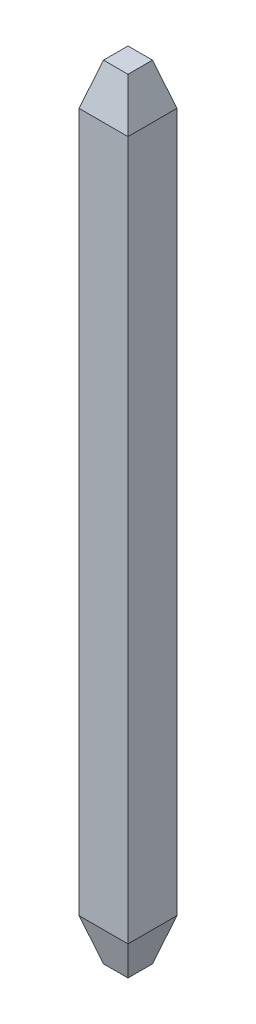
ISO-10303-21;
HEADER;
FILE_DESCRIPTION(('STEP AP214'),'2;1');
FILE_NAME('part.step','',(''),(''),'','','');
FILE_SCHEMA(('AUTOMOTIVE_DESIGN { 1 0 10303 214 1 1 1 1 }'));
ENDSEC;
DATA;
#1=APPLICATION_CONTEXT('core data for automotive mechanical design processes');
#2=APPLICATION_PROTOCOL_DEFINITION('international standard','automotive_design',2000,#1);
#3=PRODUCT_CONTEXT('',#1,'mechanical');
#4=PRODUCT('Part','Part','',(#3));
#5=PRODUCT_RELATED_PRODUCT_CATEGORY('part','',(#4));
#6=PRODUCT_DEFINITION_FORMATION('','',#4);
#7=PRODUCT_DEFINITION_CONTEXT('part definition',#1,'design');
#8=PRODUCT_DEFINITION('design','',#6,#7);
#9=PRODUCT_DEFINITION_SHAPE('','',#8);
#10=(LENGTH_UNIT() NAMED_UNIT(*) SI_UNIT(.MILLI.,.METRE.));
#11=(NAMED_UNIT(*) PLANE_ANGLE_UNIT() SI_UNIT($,.RADIAN.));
#12=(NAMED_UNIT(*) SI_UNIT($,.STERADIAN.) SOLID_ANGLE_UNIT());
#13=UNCERTAINTY_MEASURE_WITH_UNIT(LENGTH_MEASURE(1.E-05),#10,'distance_accuracy_value','');
#14=(GEOMETRIC_REPRESENTATION_CONTEXT(3) GLOBAL_UNCERTAINTY_ASSIGNED_CONTEXT((#13)) GLOBAL_UNIT_ASSIGNED_CONTEXT((#10,
#11,#12)) REPRESENTATION_CONTEXT('',''));
#15=CARTESIAN_POINT('',(0.,0.,0.));
#16=DIRECTION('',(0.,0.,1.));
#17=DIRECTION('',(1.,0.,0.));
#18=AXIS2_PLACEMENT_3D('',#15,#16,#17);
#19=CARTESIAN_POINT('',(-16.669999999987,-5.53543505344796,-19.1989999999763));
#20=DIRECTION('',(-1.,0.,0.));
#21=DIRECTION('',(0.,0.,1.));
#22=AXIS2_PLACEMENT_3D('',#19,#20,#21);
#23=PLANE('',#22);
#24=DIRECTION('',(0.,1.,0.));
#25=VECTOR('',#24,1.);
#26=CARTESIAN_POINT('',(-16.669999999987,-10.1039999999832,-19.8399999999763));
#27=LINE('',#26,#25);
#28=CARTESIAN_POINT('',(-16.669999999987,-10.1039999999832,-19.8399999999763));
#29=VERTEX_POINT('',#28);
#30=CARTESIAN_POINT('',(-16.669999999987,-0.965870106912723,-19.8399999999763));
#31=VERTEX_POINT('',#30);
#32=EDGE_CURVE('E154',#29,#31,#27,.T.);
#33=ORIENTED_EDGE('',*,*,#32,.F.);
#34=DIRECTION('',(0.,0.,-1.));
#35=VECTOR('',#34,1.);
#36=CARTESIAN_POINT('',(-16.669999999987,-10.1039999999832,-19.1999999999763));
#37=LINE('',#36,#35);
#38=CARTESIAN_POINT('',(-16.669999999987,-10.1039999999832,-19.1999999999763));
#39=VERTEX_POINT('',#38);
#40=EDGE_CURVE('E41',#39,#29,#37,.T.);
#41=ORIENTED_EDGE('',*,*,#40,.F.);
#42=DIRECTION('',(0.,1.,0.));
#43=VECTOR('',#42,1.);
#44=CARTESIAN_POINT('',(-16.669999999987,-10.1039999999832,-19.1999999999763));
#45=LINE('',#44,#43);
#46=CARTESIAN_POINT('',(-16.669999999987,-0.965870106912723,-19.1999999999763));
#47=VERTEX_POINT('',#46);
#48=EDGE_CURVE('E11',#39,#47,#45,.T.);
#49=ORIENTED_EDGE('',*,*,#48,.T.);
#50=DIRECTION('',(0.,0.,-1.));
#51=VECTOR('',#50,1.);
#52=CARTESIAN_POINT('',(-16.669999999987,-0.965870106912721,-19.1999999999763));
#53=LINE('',#52,#51);
#54=EDGE_CURVE('E28',#47,#31,#53,.T.);
#55=ORIENTED_EDGE('',*,*,#54,.T.);
#56=EDGE_LOOP('',(#33,#41,#49,#55));
#57=FACE_BOUND('',#56,.T.);
#58=ADVANCED_FACE('F17',(#57),#23,.T.);
#59=CARTESIAN_POINT('',(-16.028999999987,-5.53443505344796,-19.8399999999763));
#60=DIRECTION('',(0.,0.,-1.));
#61=DIRECTION('',(0.,-1.,0.));
#62=AXIS2_PLACEMENT_3D('',#59,#60,#61);
#63=PLANE('',#62);
#64=DIRECTION('',(0.,1.,0.));
#65=VECTOR('',#64,1.);
#66=CARTESIAN_POINT('',(-16.029999999987,-10.1039999999832,-19.8399999999763));
#67=LINE('',#66,#65);
#68=CARTESIAN_POINT('',(-16.029999999987,-10.1039999999832,-19.8399999999763));
#69=VERTEX_POINT('',#68);
#70=CARTESIAN_POINT('',(-16.029999999987,-0.965870106912723,-19.8399999999763));
#71=VERTEX_POINT('',#70);
#72=EDGE_CURVE('E121',#69,#71,#67,.T.);
#73=ORIENTED_EDGE('',*,*,#72,.F.);
#74=DIRECTION('',(1.,0.,0.));
#75=VECTOR('',#74,1.);
#76=CARTESIAN_POINT('',(-16.669999999987,-10.1039999999832,-19.8399999999763));
#77=LINE('',#76,#75);
#78=EDGE_CURVE('E101',#29,#69,#77,.T.);
#79=ORIENTED_EDGE('',*,*,#78,.F.);
#80=ORIENTED_EDGE('',*,*,#32,.T.);
#81=DIRECTION('',(1.,0.,0.));
#82=VECTOR('',#81,1.);
#83=CARTESIAN_POINT('',(-16.669999999987,-0.965870106912721,-19.8399999999763));
#84=LINE('',#83,#82);
#85=EDGE_CURVE('E133',#31,#71,#84,.T.);
#86=ORIENTED_EDGE('',*,*,#85,.T.);
#87=EDGE_LOOP('',(#73,#79,#80,#86));
#88=FACE_BOUND('',#87,.T.);
#89=ADVANCED_FACE('F132',(#88),#63,.T.);
#90=CARTESIAN_POINT('',(-16.029999999987,-11.0738701069127,-19.5199999999763));
#91=DIRECTION('',(1.,0.,0.));
#92=DIRECTION('',(0.,1.,0.));
#93=AXIS2_PLACEMENT_3D('',#90,#91,#92);
#94=PLANE('',#93);
#95=DIRECTION('',(0.,1.,0.));
#96=VECTOR('',#95,1.);
#97=CARTESIAN_POINT('',(-16.029999999987,-10.1039999999832,-19.1999999999763));
#98=LINE('',#97,#96);
#99=CARTESIAN_POINT('',(-16.029999999987,-10.1039999999832,-19.1999999999763));
#100=VERTEX_POINT('',#99);
#101=CARTESIAN_POINT('',(-16.029999999987,-0.965870106912723,-19.1999999999763));
#102=VERTEX_POINT('',#101);
#103=EDGE_CURVE('E123',#100,#102,#98,.T.);
#104=ORIENTED_EDGE('',*,*,#103,.F.);
#105=DIRECTION('',(0.,0.,1.));
#106=VECTOR('',#105,1.);
#107=CARTESIAN_POINT('',(-16.029999999987,-10.1039999999832,-19.8399999999763));
#108=LINE('',#107,#106);
#109=EDGE_CURVE('E118',#69,#100,#108,.T.);
#110=ORIENTED_EDGE('',*,*,#109,.F.);
#111=ORIENTED_EDGE('',*,*,#72,.T.);
#112=DIRECTION('',(0.,0.,1.));
#113=VECTOR('',#112,1.);
#114=CARTESIAN_POINT('',(-16.029999999987,-0.965870106912721,-19.8399999999763));
#115=LINE('',#114,#113);
#116=EDGE_CURVE('E136',#71,#102,#115,.T.);
#117=ORIENTED_EDGE('',*,*,#116,.T.);
#118=EDGE_LOOP('',(#104,#110,#111,#117));
#119=FACE_BOUND('',#118,.T.);
#120=ADVANCED_FACE('F119',(#119),#94,.T.);
#121=CARTESIAN_POINT('',(-16.029999999987,-0.965870106912721,-19.5199999999763));
#122=DIRECTION('',(0.95964490090097,0.281214622974636,0.));
#123=DIRECTION('',(0.,0.,-1.));
#124=AXIS2_PLACEMENT_3D('',#121,#122,#123);
#125=PLANE('',#124);
#126=DIRECTION('',(-0.27071401714772,0.923811583516619,0.270714017147728));
#127=VECTOR('',#126,1.);
#128=CARTESIAN_POINT('',(-16.029999999987,-0.965870106912721,-19.8399999999763));
#129=LINE('',#128,#127);
#130=CARTESIAN_POINT('',(-16.189999999987,-0.419870106912724,-19.6799999999763));
#131=VERTEX_POINT('',#130);
#132=EDGE_CURVE('E159',#71,#131,#129,.T.);
#133=ORIENTED_EDGE('',*,*,#132,.T.);
#134=DIRECTION('',(0.,0.,1.));
#135=VECTOR('',#134,1.);
#136=CARTESIAN_POINT('',(-16.189999999987,-0.419870106912722,-19.6799999999763));
#137=LINE('',#136,#135);
#138=CARTESIAN_POINT('',(-16.189999999987,-0.419870106912724,-19.3599999999763));
#139=VERTEX_POINT('',#138);
#140=EDGE_CURVE('E163',#131,#139,#137,.T.);
#141=ORIENTED_EDGE('',*,*,#140,.T.);
#142=DIRECTION('',(-0.27071401714772,0.923811583516619,-0.270714017147728));
#143=VECTOR('',#142,1.);
#144=CARTESIAN_POINT('',(-16.029999999987,-0.965870106912721,-19.1999999999763));
#145=LINE('',#144,#143);
#146=EDGE_CURVE('E164',#102,#139,#145,.T.);
#147=ORIENTED_EDGE('',*,*,#146,.F.);
#148=ORIENTED_EDGE('',*,*,#116,.F.);
#149=EDGE_LOOP('',(#133,#141,#147,#148));
#150=FACE_BOUND('',#149,.T.);
#151=ADVANCED_FACE('F232',(#150),#125,.T.);
#152=CARTESIAN_POINT('',(-16.349999999987,-0.965870106912721,-19.1999999999763));
#153=DIRECTION('',(0.,0.281214622974643,0.959644900900968));
#154=DIRECTION('',(1.,0.,0.));
#155=AXIS2_PLACEMENT_3D('',#152,#153,#154);
#156=PLANE('',#155);
#157=ORIENTED_EDGE('',*,*,#146,.T.);
#158=DIRECTION('',(-1.,0.,0.));
#159=VECTOR('',#158,1.);
#160=CARTESIAN_POINT('',(-16.189999999987,-0.419870106912722,-19.3599999999763));
#161=LINE('',#160,#159);
#162=CARTESIAN_POINT('',(-16.509999999987,-0.419870106912724,-19.3599999999763));
#163=VERTEX_POINT('',#162);
#164=EDGE_CURVE('E129',#139,#163,#161,.T.);
#165=ORIENTED_EDGE('',*,*,#164,.T.);
#166=DIRECTION('',(0.270714017147727,0.923811583516617,-0.270714017147727));
#167=VECTOR('',#166,1.);
#168=CARTESIAN_POINT('',(-16.669999999987,-0.965870106912721,-19.1999999999763));
#169=LINE('',#168,#167);
#170=EDGE_CURVE('E141',#47,#163,#169,.T.);
#171=ORIENTED_EDGE('',*,*,#170,.F.);
#172=DIRECTION('',(-1.,0.,0.));
#173=VECTOR('',#172,1.);
#174=CARTESIAN_POINT('',(-16.029999999987,-0.965870106912721,-19.1999999999763));
#175=LINE('',#174,#173);
#176=EDGE_CURVE('E170',#102,#47,#175,.T.);
#177=ORIENTED_EDGE('',*,*,#176,.F.);
#178=EDGE_LOOP('',(#157,#165,#171,#177));
#179=FACE_BOUND('',#178,.T.);
#180=ADVANCED_FACE('F238',(#179),#156,.T.);
#181=CARTESIAN_POINT('',(-16.349999999987,-0.419870106912722,-19.6809999999763));
#182=DIRECTION('',(0.,1.,0.));
#183=DIRECTION('',(1.,0.,0.));
#184=AXIS2_PLACEMENT_3D('',#181,#182,#183);
#185=PLANE('',#184);
#186=DIRECTION('',(1.,0.,0.));
#187=VECTOR('',#186,1.);
#188=CARTESIAN_POINT('',(-16.509999999987,-0.419870106912722,-19.6799999999763));
#189=LINE('',#188,#187);
#190=CARTESIAN_POINT('',(-16.509999999987,-0.419870106912724,-19.6799999999763));
#191=VERTEX_POINT('',#190);
#192=EDGE_CURVE('E113',#191,#131,#189,.T.);
#193=ORIENTED_EDGE('',*,*,#192,.F.);
#194=DIRECTION('',(0.,0.,-1.));
#195=VECTOR('',#194,1.);
#196=CARTESIAN_POINT('',(-16.509999999987,-0.419870106912722,-19.3599999999763));
#197=LINE('',#196,#195);
#198=EDGE_CURVE('E147',#163,#191,#197,.T.);
#199=ORIENTED_EDGE('',*,*,#198,.F.);
#200=ORIENTED_EDGE('',*,*,#164,.F.);
#201=ORIENTED_EDGE('',*,*,#140,.F.);
#202=EDGE_LOOP('',(#193,#199,#200,#201));
#203=FACE_BOUND('',#202,.T.);
#204=ADVANCED_FACE('F236',(#203),#185,.T.);
#205=CARTESIAN_POINT('',(-16.029999999987,-10.1039999999832,-19.5199999999763));
#206=DIRECTION('',(0.95964490090097,-0.281214622974636,0.));
#207=DIRECTION('',(0.,0.,-1.));
#208=AXIS2_PLACEMENT_3D('',#205,#206,#207);
#209=PLANE('',#208);
#210=ORIENTED_EDGE('',*,*,#109,.T.);
#211=DIRECTION('',(-0.27071401714772,-0.923811583516619,-0.270714017147728));
#212=VECTOR('',#211,1.);
#213=CARTESIAN_POINT('',(-16.029999999987,-10.1039999999832,-19.1999999999763));
#214=LINE('',#213,#212);
#215=CARTESIAN_POINT('',(-16.189999999987,-10.6499999999832,-19.3599999999763));
#216=VERTEX_POINT('',#215);
#217=EDGE_CURVE('E130',#100,#216,#214,.T.);
#218=ORIENTED_EDGE('',*,*,#217,.T.);
#219=DIRECTION('',(0.,0.,1.));
#220=VECTOR('',#219,1.);
#221=CARTESIAN_POINT('',(-16.189999999987,-10.6499999999832,-19.6799999999763));
#222=LINE('',#221,#220);
#223=CARTESIAN_POINT('',(-16.189999999987,-10.6499999999832,-19.6799999999763));
#224=VERTEX_POINT('',#223);
#225=EDGE_CURVE('E138',#224,#216,#222,.T.);
#226=ORIENTED_EDGE('',*,*,#225,.F.);
#227=DIRECTION('',(-0.27071401714772,-0.923811583516619,0.270714017147728));
#228=VECTOR('',#227,1.);
#229=CARTESIAN_POINT('',(-16.029999999987,-10.1039999999832,-19.8399999999763));
#230=LINE('',#229,#228);
#231=EDGE_CURVE('E105',#69,#224,#230,.T.);
#232=ORIENTED_EDGE('',*,*,#231,.F.);
#233=EDGE_LOOP('',(#210,#218,#226,#232));
#234=FACE_BOUND('',#233,.T.);
#235=ADVANCED_FACE('F19',(#234),#209,.T.);
#236=CARTESIAN_POINT('',(-16.510999999987,-10.6499999999832,-19.5199999999763));
#237=DIRECTION('',(0.,-1.,0.));
#238=DIRECTION('',(0.,0.,-1.));
#239=AXIS2_PLACEMENT_3D('',#236,#237,#238);
#240=PLANE('',#239);
#241=ORIENTED_EDGE('',*,*,#225,.T.);
#242=DIRECTION('',(-1.,0.,0.));
#243=VECTOR('',#242,1.);
#244=CARTESIAN_POINT('',(-16.189999999987,-10.6499999999832,-19.3599999999763));
#245=LINE('',#244,#243);
#246=CARTESIAN_POINT('',(-16.509999999987,-10.6499999999832,-19.3599999999763));
#247=VERTEX_POINT('',#246);
#248=EDGE_CURVE('E178',#216,#247,#245,.T.);
#249=ORIENTED_EDGE('',*,*,#248,.T.);
#250=DIRECTION('',(0.,0.,-1.));
#251=VECTOR('',#250,1.);
#252=CARTESIAN_POINT('',(-16.509999999987,-10.6499999999832,-19.3599999999763));
#253=LINE('',#252,#251);
#254=CARTESIAN_POINT('',(-16.509999999987,-10.6499999999832,-19.6799999999763));
#255=VERTEX_POINT('',#254);
#256=EDGE_CURVE('E21',#247,#255,#253,.T.);
#257=ORIENTED_EDGE('',*,*,#256,.T.);
#258=DIRECTION('',(1.,0.,0.));
#259=VECTOR('',#258,1.);
#260=CARTESIAN_POINT('',(-16.509999999987,-10.6499999999832,-19.6799999999763));
#261=LINE('',#260,#259);
#262=EDGE_CURVE('E204',#255,#224,#261,.T.);
#263=ORIENTED_EDGE('',*,*,#262,.T.);
#264=EDGE_LOOP('',(#241,#249,#257,#263));
#265=FACE_BOUND('',#264,.T.);
#266=ADVANCED_FACE('F246',(#265),#240,.T.);
#267=CARTESIAN_POINT('',(-16.349999999987,-10.1039999999832,-19.1999999999763));
#268=DIRECTION('',(0.,-0.281214622974643,0.959644900900968));
#269=DIRECTION('',(-1.,0.,0.));
#270=AXIS2_PLACEMENT_3D('',#267,#268,#269);
#271=PLANE('',#270);
#272=DIRECTION('',(-1.,0.,0.));
#273=VECTOR('',#272,1.);
#274=CARTESIAN_POINT('',(-16.029999999987,-10.1039999999832,-19.1999999999763));
#275=LINE('',#274,#273);
#276=EDGE_CURVE('E183',#100,#39,#275,.T.);
#277=ORIENTED_EDGE('',*,*,#276,.T.);
#278=DIRECTION('',(0.270714017147727,-0.923811583516618,-0.270714017147727));
#279=VECTOR('',#278,1.);
#280=CARTESIAN_POINT('',(-16.669999999987,-10.1039999999832,-19.1999999999763));
#281=LINE('',#280,#279);
#282=EDGE_CURVE('E179',#39,#247,#281,.T.);
#283=ORIENTED_EDGE('',*,*,#282,.T.);
#284=ORIENTED_EDGE('',*,*,#248,.F.);
#285=ORIENTED_EDGE('',*,*,#217,.F.);
#286=EDGE_LOOP('',(#277,#283,#284,#285));
#287=FACE_BOUND('',#286,.T.);
#288=ADVANCED_FACE('F196',(#287),#271,.T.);
#289=CARTESIAN_POINT('',(-16.349999999987,-0.965870106912721,-19.8399999999763));
#290=DIRECTION('',(0.,0.281214622974643,-0.959644900900968));
#291=DIRECTION('',(-1.,0.,0.));
#292=AXIS2_PLACEMENT_3D('',#289,#290,#291);
#293=PLANE('',#292);
#294=DIRECTION('',(0.270714017147727,0.923811583516617,0.270714017147727));
#295=VECTOR('',#294,1.);
#296=CARTESIAN_POINT('',(-16.669999999987,-0.965870106912721,-19.8399999999763));
#297=LINE('',#296,#295);
#298=EDGE_CURVE('E158',#31,#191,#297,.T.);
#299=ORIENTED_EDGE('',*,*,#298,.T.);
#300=ORIENTED_EDGE('',*,*,#192,.T.);
#301=ORIENTED_EDGE('',*,*,#132,.F.);
#302=ORIENTED_EDGE('',*,*,#85,.F.);
#303=EDGE_LOOP('',(#299,#300,#301,#302));
#304=FACE_BOUND('',#303,.T.);
#305=ADVANCED_FACE('F255',(#304),#293,.T.);
#306=CARTESIAN_POINT('',(-16.349999999987,-10.1039999999832,-19.8399999999763));
#307=DIRECTION('',(0.,-0.281214622974643,-0.959644900900968));
#308=DIRECTION('',(0.,-0.959644900900968,0.281214622974643));
#309=AXIS2_PLACEMENT_3D('',#306,#307,#308);
#310=PLANE('',#309);
#311=ORIENTED_EDGE('',*,*,#78,.T.);
#312=ORIENTED_EDGE('',*,*,#231,.T.);
#313=ORIENTED_EDGE('',*,*,#262,.F.);
#314=DIRECTION('',(0.270714017147727,-0.923811583516618,0.270714017147727));
#315=VECTOR('',#314,1.);
#316=CARTESIAN_POINT('',(-16.669999999987,-10.1039999999832,-19.8399999999763));
#317=LINE('',#316,#315);
#318=EDGE_CURVE('E107',#29,#255,#317,.T.);
#319=ORIENTED_EDGE('',*,*,#318,.F.);
#320=EDGE_LOOP('',(#311,#312,#313,#319));
#321=FACE_BOUND('',#320,.T.);
#322=ADVANCED_FACE('F103',(#321),#310,.T.);
#323=CARTESIAN_POINT('',(-16.669999999987,-0.965870106912721,-19.5199999999763));
#324=DIRECTION('',(-0.959644900900968,0.281214622974643,0.));
#325=DIRECTION('',(0.,0.,1.));
#326=AXIS2_PLACEMENT_3D('',#323,#324,#325);
#327=PLANE('',#326);
#328=ORIENTED_EDGE('',*,*,#170,.T.);
#329=ORIENTED_EDGE('',*,*,#198,.T.);
#330=ORIENTED_EDGE('',*,*,#298,.F.);
#331=ORIENTED_EDGE('',*,*,#54,.F.);
#332=EDGE_LOOP('',(#328,#329,#330,#331));
#333=FACE_BOUND('',#332,.T.);
#334=ADVANCED_FACE('F242',(#333),#327,.T.);
#335=CARTESIAN_POINT('',(-16.670999999987,-5.53543505344796,-19.1999999999763));
#336=DIRECTION('',(0.,0.,1.));
#337=DIRECTION('',(1.,0.,0.));
#338=AXIS2_PLACEMENT_3D('',#335,#336,#337);
#339=PLANE('',#338);
#340=ORIENTED_EDGE('',*,*,#48,.F.);
#341=ORIENTED_EDGE('',*,*,#276,.F.);
#342=ORIENTED_EDGE('',*,*,#103,.T.);
#343=ORIENTED_EDGE('',*,*,#176,.T.);
#344=EDGE_LOOP('',(#340,#341,#342,#343));
#345=FACE_BOUND('',#344,.T.);
#346=ADVANCED_FACE('F244',(#345),#339,.T.);
#347=CARTESIAN_POINT('',(-16.669999999987,-10.1039999999832,-19.5199999999763));
#348=DIRECTION('',(-0.959644900900968,-0.281214622974643,0.));
#349=DIRECTION('',(-0.281214622974643,0.959644900900968,0.));
#350=AXIS2_PLACEMENT_3D('',#347,#348,#349);
#351=PLANE('',#350);
#352=ORIENTED_EDGE('',*,*,#40,.T.);
#353=ORIENTED_EDGE('',*,*,#318,.T.);
#354=ORIENTED_EDGE('',*,*,#256,.F.);
#355=ORIENTED_EDGE('',*,*,#282,.F.);
#356=EDGE_LOOP('',(#352,#353,#354,#355));
#357=FACE_BOUND('',#356,.T.);
#358=ADVANCED_FACE('F245',(#357),#351,.T.);
#359=CLOSED_SHELL('',(#58,#89,#120,#151,#180,#204,#235,#266,#288,#305,#322,#334,#346,#358));
#360=MANIFOLD_SOLID_BREP('B1',#359);
#361=ADVANCED_BREP_SHAPE_REPRESENTATION('',(#18,#360),#14);
#362=SHAPE_DEFINITION_REPRESENTATION(#9,#361);
ENDSEC;
END-ISO-10303-21;
